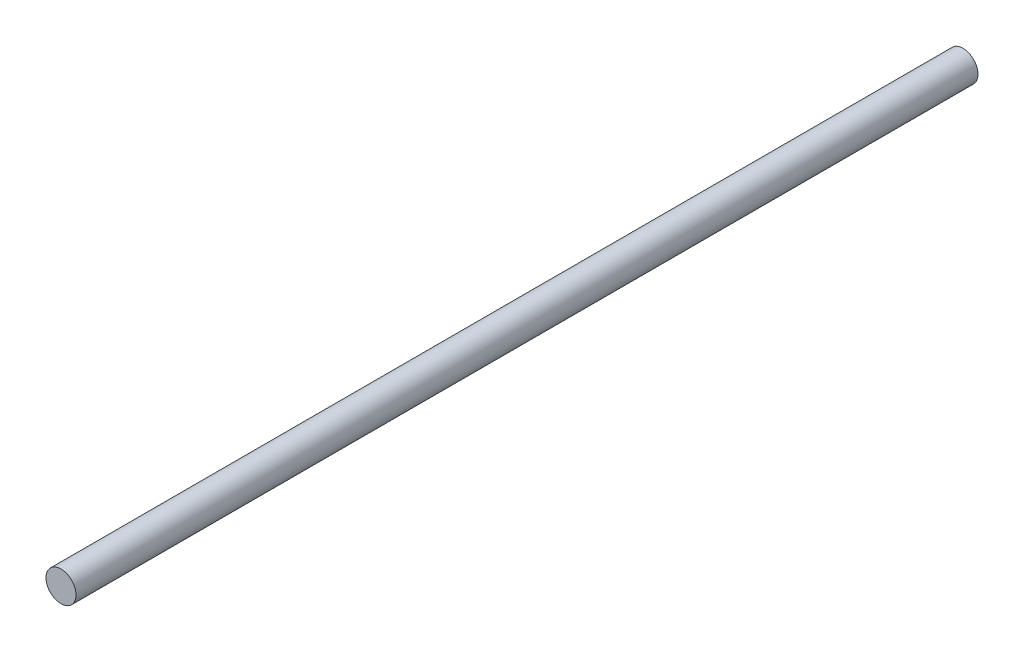
ISO-10303-21;
HEADER;
FILE_DESCRIPTION(('STEP AP214'),'2;1');
FILE_NAME('part.step','',(''),(''),'','','');
FILE_SCHEMA(('AUTOMOTIVE_DESIGN { 1 0 10303 214 1 1 1 1 }'));
ENDSEC;
DATA;
#1=APPLICATION_CONTEXT('core data for automotive mechanical design processes');
#2=APPLICATION_PROTOCOL_DEFINITION('international standard','automotive_design',2000,#1);
#3=PRODUCT_CONTEXT('',#1,'mechanical');
#4=PRODUCT('Part','Part','',(#3));
#5=PRODUCT_RELATED_PRODUCT_CATEGORY('part','',(#4));
#6=PRODUCT_DEFINITION_FORMATION('','',#4);
#7=PRODUCT_DEFINITION_CONTEXT('part definition',#1,'design');
#8=PRODUCT_DEFINITION('design','',#6,#7);
#9=PRODUCT_DEFINITION_SHAPE('','',#8);
#10=(LENGTH_UNIT() NAMED_UNIT(*) SI_UNIT(.MILLI.,.METRE.));
#11=(NAMED_UNIT(*) PLANE_ANGLE_UNIT() SI_UNIT($,.RADIAN.));
#12=(NAMED_UNIT(*) SI_UNIT($,.STERADIAN.) SOLID_ANGLE_UNIT());
#13=UNCERTAINTY_MEASURE_WITH_UNIT(LENGTH_MEASURE(1.E-05),#10,'distance_accuracy_value','');
#14=(GEOMETRIC_REPRESENTATION_CONTEXT(3) GLOBAL_UNCERTAINTY_ASSIGNED_CONTEXT((#13)) GLOBAL_UNIT_ASSIGNED_CONTEXT((#10,
#11,#12)) REPRESENTATION_CONTEXT('',''));
#15=CARTESIAN_POINT('',(0.,0.,0.));
#16=DIRECTION('',(0.,0.,1.));
#17=DIRECTION('',(1.,0.,0.));
#18=AXIS2_PLACEMENT_3D('',#15,#16,#17);
#19=CARTESIAN_POINT('',(0.,0.,762.));
#20=DIRECTION('',(0.,0.,-1.));
#21=DIRECTION('',(-1.,0.,0.));
#22=AXIS2_PLACEMENT_3D('',#19,#20,#21);
#23=CYLINDRICAL_SURFACE('',#22,12.7);
#24=CARTESIAN_POINT('',(0.,0.,762.));
#25=DIRECTION('',(0.,0.,1.));
#26=DIRECTION('',(1.,0.,0.));
#27=AXIS2_PLACEMENT_3D('',#24,#25,#26);
#28=CIRCLE('',#27,12.7);
#29=CARTESIAN_POINT('',(12.7,0.,762.));
#30=VERTEX_POINT('',#29);
#31=EDGE_CURVE('E10',#30,#30,#28,.T.);
#32=ORIENTED_EDGE('',*,*,#31,.F.);
#33=EDGE_LOOP('',(#32));
#34=FACE_BOUND('',#33,.T.);
#35=CARTESIAN_POINT('',(0.,0.,0.));
#36=DIRECTION('',(0.,0.,1.));
#37=DIRECTION('',(1.,0.,0.));
#38=AXIS2_PLACEMENT_3D('',#35,#36,#37);
#39=CIRCLE('',#38,12.7);
#40=CARTESIAN_POINT('',(12.7,0.,0.));
#41=VERTEX_POINT('',#40);
#42=EDGE_CURVE('E40',#41,#41,#39,.T.);
#43=ORIENTED_EDGE('',*,*,#42,.T.);
#44=EDGE_LOOP('',(#43));
#45=FACE_BOUND('',#44,.T.);
#46=ADVANCED_FACE('F37',(#34,#45),#23,.T.);
#47=CARTESIAN_POINT('',(0.,0.,762.));
#48=DIRECTION('',(0.,0.,1.));
#49=DIRECTION('',(1.,0.,0.));
#50=AXIS2_PLACEMENT_3D('',#47,#48,#49);
#51=PLANE('',#50);
#52=ORIENTED_EDGE('',*,*,#31,.T.);
#53=EDGE_LOOP('',(#52));
#54=FACE_BOUND('',#53,.T.);
#55=ADVANCED_FACE('F54',(#54),#51,.T.);
#56=CARTESIAN_POINT('',(0.,0.,0.));
#57=DIRECTION('',(0.,0.,1.));
#58=DIRECTION('',(1.,0.,0.));
#59=AXIS2_PLACEMENT_3D('',#56,#57,#58);
#60=PLANE('',#59);
#61=ORIENTED_EDGE('',*,*,#42,.F.);
#62=EDGE_LOOP('',(#61));
#63=FACE_BOUND('',#62,.T.);
#64=ADVANCED_FACE('F52',(#63),#60,.F.);
#65=CLOSED_SHELL('',(#46,#55,#64));
#66=MANIFOLD_SOLID_BREP('B2',#65);
#67=ADVANCED_BREP_SHAPE_REPRESENTATION('',(#18,#66),#14);
#68=SHAPE_DEFINITION_REPRESENTATION(#9,#67);
ENDSEC;
END-ISO-10303-21;
